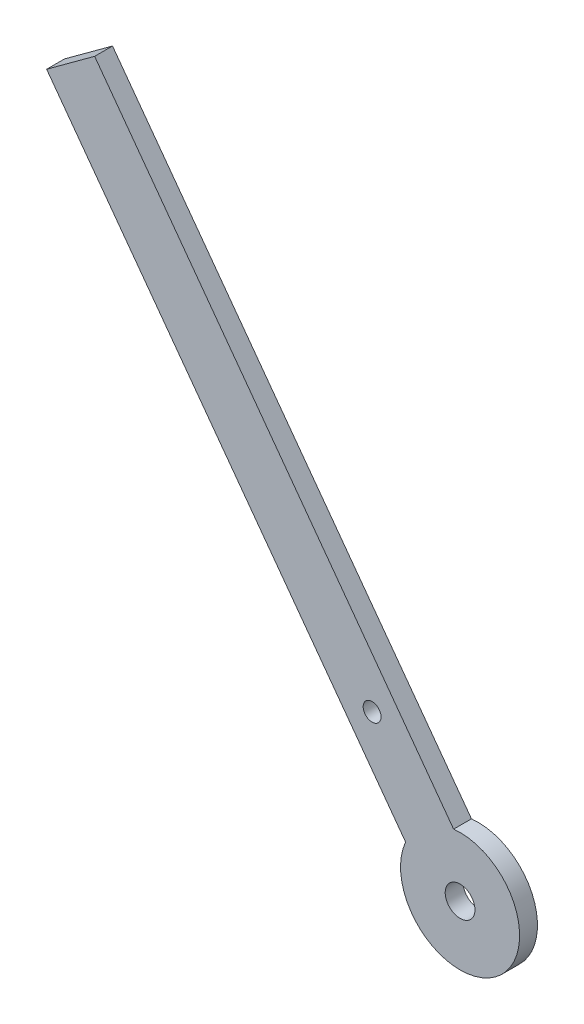
ISO-10303-21;
HEADER;
FILE_DESCRIPTION(('STEP AP214'),'2;1');
FILE_NAME('part.step','',(''),(''),'','','');
FILE_SCHEMA(('AUTOMOTIVE_DESIGN { 1 0 10303 214 1 1 1 1 }'));
ENDSEC;
DATA;
#1=APPLICATION_CONTEXT('core data for automotive mechanical design processes');
#2=APPLICATION_PROTOCOL_DEFINITION('international standard','automotive_design',2000,#1);
#3=PRODUCT_CONTEXT('',#1,'mechanical');
#4=PRODUCT('Part','Part','',(#3));
#5=PRODUCT_RELATED_PRODUCT_CATEGORY('part','',(#4));
#6=PRODUCT_DEFINITION_FORMATION('','',#4);
#7=PRODUCT_DEFINITION_CONTEXT('part definition',#1,'design');
#8=PRODUCT_DEFINITION('design','',#6,#7);
#9=PRODUCT_DEFINITION_SHAPE('','',#8);
#10=(LENGTH_UNIT() NAMED_UNIT(*) SI_UNIT(.MILLI.,.METRE.));
#11=(NAMED_UNIT(*) PLANE_ANGLE_UNIT() SI_UNIT($,.RADIAN.));
#12=(NAMED_UNIT(*) SI_UNIT($,.STERADIAN.) SOLID_ANGLE_UNIT());
#13=UNCERTAINTY_MEASURE_WITH_UNIT(LENGTH_MEASURE(1.E-05),#10,'distance_accuracy_value','');
#14=(GEOMETRIC_REPRESENTATION_CONTEXT(3) GLOBAL_UNCERTAINTY_ASSIGNED_CONTEXT((#13)) GLOBAL_UNIT_ASSIGNED_CONTEXT((#10,
#11,#12)) REPRESENTATION_CONTEXT('',''));
#15=CARTESIAN_POINT('',(0.,0.,0.));
#16=DIRECTION('',(0.,0.,1.));
#17=DIRECTION('',(1.,0.,0.));
#18=AXIS2_PLACEMENT_3D('',#15,#16,#17);
#19=CARTESIAN_POINT('',(0.,0.,3.));
#20=DIRECTION('',(0.,0.,1.));
#21=DIRECTION('',(1.,0.,0.));
#22=AXIS2_PLACEMENT_3D('',#19,#20,#21);
#23=PLANE('',#22);
#24=CARTESIAN_POINT('',(0.,0.,3.));
#25=DIRECTION('',(0.,0.,1.));
#26=DIRECTION('',(1.,0.,0.));
#27=AXIS2_PLACEMENT_3D('',#24,#25,#26);
#28=CIRCLE('',#27,2.49999999988457);
#29=CARTESIAN_POINT('',(2.49999999988457,0.,3.));
#30=VERTEX_POINT('',#29);
#31=EDGE_CURVE('E99',#30,#30,#28,.T.);
#32=ORIENTED_EDGE('',*,*,#31,.F.);
#33=EDGE_LOOP('',(#32));
#34=FACE_BOUND('',#33,.T.);
#35=DIRECTION('',(-0.806588676447801,-0.591113108487863,0.));
#36=VECTOR('',#35,1.);
#37=CARTESIAN_POINT('',(-65.4127267503671,89.2573078397623,3.));
#38=LINE('',#37,#36);
#39=CARTESIAN_POINT('',(-61.3797833681282,92.2128733822015,3.));
#40=VERTEX_POINT('',#39);
#41=CARTESIAN_POINT('',(-69.4456701326071,86.3017422973222,3.));
#42=VERTEX_POINT('',#41);
#43=EDGE_CURVE('E79',#40,#42,#38,.T.);
#44=ORIENTED_EDGE('',*,*,#43,.T.);
#45=DIRECTION('',(0.591113108487865,-0.8065886764478,0.));
#46=VECTOR('',#45,1.);
#47=CARTESIAN_POINT('',(-69.4456701326071,86.3017422973222,3.));
#48=LINE('',#47,#46);
#49=CARTESIAN_POINT('',(-9.15213306684436,4.029697299646,3.));
#50=VERTEX_POINT('',#49);
#51=EDGE_CURVE('E82',#42,#50,#48,.T.);
#52=ORIENTED_EDGE('',*,*,#51,.T.);
#53=CARTESIAN_POINT('',(0.,0.,3.));
#54=DIRECTION('',(0.,0.,1.));
#55=DIRECTION('',(1.,0.,0.));
#56=AXIS2_PLACEMENT_3D('',#53,#54,#55);
#57=CIRCLE('',#56,10.);
#58=CARTESIAN_POINT('',(-1.08624630236598,9.94082838452594,3.));
#59=VERTEX_POINT('',#58);
#60=EDGE_CURVE('E86',#50,#59,#57,.T.);
#61=ORIENTED_EDGE('',*,*,#60,.T.);
#62=DIRECTION('',(-0.591113108487865,0.8065886764478,0.));
#63=VECTOR('',#62,1.);
#64=CARTESIAN_POINT('',(-61.3797833681282,92.2128733822015,3.));
#65=LINE('',#64,#63);
#66=EDGE_CURVE('E50',#59,#40,#65,.T.);
#67=ORIENTED_EDGE('',*,*,#66,.T.);
#68=EDGE_LOOP('',(#44,#52,#61,#67));
#69=FACE_BOUND('',#68,.T.);
#70=CARTESIAN_POINT('',(-14.7778277121965,20.1647169111948,3.));
#71=DIRECTION('',(0.,0.,1.));
#72=DIRECTION('',(1.,0.,0.));
#73=AXIS2_PLACEMENT_3D('',#70,#71,#72);
#74=CIRCLE('',#73,1.50000000177059);
#75=CARTESIAN_POINT('',(-13.2778277104259,20.1647169111948,3.));
#76=VERTEX_POINT('',#75);
#77=EDGE_CURVE('E120',#76,#76,#74,.T.);
#78=ORIENTED_EDGE('',*,*,#77,.F.);
#79=EDGE_LOOP('',(#78));
#80=FACE_BOUND('',#79,.T.);
#81=ADVANCED_FACE('F33',(#34,#69,#80),#23,.T.);
#82=CARTESIAN_POINT('',(0.,0.,0.));
#83=DIRECTION('',(0.,0.,1.));
#84=DIRECTION('',(1.,0.,0.));
#85=AXIS2_PLACEMENT_3D('',#82,#83,#84);
#86=PLANE('',#85);
#87=DIRECTION('',(-0.806588676447799,-0.591113108487866,0.));
#88=VECTOR('',#87,1.);
#89=CARTESIAN_POINT('',(-65.4127267503671,89.2573078397623,0.));
#90=LINE('',#89,#88);
#91=CARTESIAN_POINT('',(-61.3797833681282,92.2128733822015,0.));
#92=VERTEX_POINT('',#91);
#93=CARTESIAN_POINT('',(-69.4456701326071,86.3017422973222,0.));
#94=VERTEX_POINT('',#93);
#95=EDGE_CURVE('E74',#92,#94,#90,.T.);
#96=ORIENTED_EDGE('',*,*,#95,.F.);
#97=DIRECTION('',(-0.591113108487865,0.8065886764478,0.));
#98=VECTOR('',#97,1.);
#99=CARTESIAN_POINT('',(-61.3797833681282,92.2128733822015,0.));
#100=LINE('',#99,#98);
#101=CARTESIAN_POINT('',(-1.08624630236598,9.94082838452594,0.));
#102=VERTEX_POINT('',#101);
#103=EDGE_CURVE('E102',#102,#92,#100,.T.);
#104=ORIENTED_EDGE('',*,*,#103,.F.);
#105=CARTESIAN_POINT('',(0.,0.,0.));
#106=DIRECTION('',(0.,0.,1.));
#107=DIRECTION('',(1.,0.,0.));
#108=AXIS2_PLACEMENT_3D('',#105,#106,#107);
#109=CIRCLE('',#108,10.);
#110=CARTESIAN_POINT('',(-9.15213306684436,4.029697299646,0.));
#111=VERTEX_POINT('',#110);
#112=EDGE_CURVE('E67',#111,#102,#109,.T.);
#113=ORIENTED_EDGE('',*,*,#112,.F.);
#114=DIRECTION('',(0.591113108487865,-0.8065886764478,0.));
#115=VECTOR('',#114,1.);
#116=CARTESIAN_POINT('',(-69.4456701326071,86.3017422973222,0.));
#117=LINE('',#116,#115);
#118=EDGE_CURVE('E90',#94,#111,#117,.T.);
#119=ORIENTED_EDGE('',*,*,#118,.F.);
#120=EDGE_LOOP('',(#96,#104,#113,#119));
#121=FACE_BOUND('',#120,.T.);
#122=CARTESIAN_POINT('',(0.,0.,0.));
#123=DIRECTION('',(0.,0.,1.));
#124=DIRECTION('',(1.,0.,0.));
#125=AXIS2_PLACEMENT_3D('',#122,#123,#124);
#126=CIRCLE('',#125,2.49999999988457);
#127=CARTESIAN_POINT('',(2.49999999988457,0.,0.));
#128=VERTEX_POINT('',#127);
#129=EDGE_CURVE('E115',#128,#128,#126,.T.);
#130=ORIENTED_EDGE('',*,*,#129,.T.);
#131=EDGE_LOOP('',(#130));
#132=FACE_BOUND('',#131,.T.);
#133=CARTESIAN_POINT('',(-14.7778277121965,20.1647169111948,0.));
#134=DIRECTION('',(0.,0.,1.));
#135=DIRECTION('',(1.,0.,0.));
#136=AXIS2_PLACEMENT_3D('',#133,#134,#135);
#137=CIRCLE('',#136,1.50000000177059);
#138=CARTESIAN_POINT('',(-13.2778277104259,20.1647169111948,0.));
#139=VERTEX_POINT('',#138);
#140=EDGE_CURVE('E118',#139,#139,#137,.T.);
#141=ORIENTED_EDGE('',*,*,#140,.T.);
#142=EDGE_LOOP('',(#141));
#143=FACE_BOUND('',#142,.T.);
#144=ADVANCED_FACE('F108',(#121,#132,#143),#86,.F.);
#145=CARTESIAN_POINT('',(-65.4127267503671,89.2573078397623,3.));
#146=DIRECTION('',(0.591113108487866,-0.806588676447799,0.));
#147=DIRECTION('',(0.806588676447799,0.591113108487866,0.));
#148=AXIS2_PLACEMENT_3D('',#145,#146,#147);
#149=PLANE('',#148);
#150=ORIENTED_EDGE('',*,*,#95,.T.);
#151=DIRECTION('',(0.,0.,-1.));
#152=VECTOR('',#151,1.);
#153=CARTESIAN_POINT('',(-69.4456701326071,86.3017422973222,3.));
#154=LINE('',#153,#152);
#155=EDGE_CURVE('E11',#42,#94,#154,.T.);
#156=ORIENTED_EDGE('',*,*,#155,.F.);
#157=ORIENTED_EDGE('',*,*,#43,.F.);
#158=DIRECTION('',(0.,0.,-1.));
#159=VECTOR('',#158,1.);
#160=CARTESIAN_POINT('',(-61.3797833681282,92.2128733822015,3.));
#161=LINE('',#160,#159);
#162=EDGE_CURVE('E94',#40,#92,#161,.T.);
#163=ORIENTED_EDGE('',*,*,#162,.T.);
#164=EDGE_LOOP('',(#150,#156,#157,#163));
#165=FACE_BOUND('',#164,.T.);
#166=ADVANCED_FACE('F35',(#165),#149,.F.);
#167=CARTESIAN_POINT('',(-69.4456701326071,86.3017422973222,3.));
#168=DIRECTION('',(0.8065886764478,0.591113108487865,0.));
#169=DIRECTION('',(-0.591113108487865,0.8065886764478,0.));
#170=AXIS2_PLACEMENT_3D('',#167,#168,#169);
#171=PLANE('',#170);
#172=ORIENTED_EDGE('',*,*,#118,.T.);
#173=DIRECTION('',(0.,0.,-1.));
#174=VECTOR('',#173,1.);
#175=CARTESIAN_POINT('',(-9.15213306684436,4.029697299646,3.));
#176=LINE('',#175,#174);
#177=EDGE_CURVE('E42',#50,#111,#176,.T.);
#178=ORIENTED_EDGE('',*,*,#177,.F.);
#179=ORIENTED_EDGE('',*,*,#51,.F.);
#180=ORIENTED_EDGE('',*,*,#155,.T.);
#181=EDGE_LOOP('',(#172,#178,#179,#180));
#182=FACE_BOUND('',#181,.T.);
#183=ADVANCED_FACE('F89',(#182),#171,.F.);
#184=CARTESIAN_POINT('',(0.,0.,3.));
#185=DIRECTION('',(0.,0.,-1.));
#186=DIRECTION('',(-1.,0.,0.));
#187=AXIS2_PLACEMENT_3D('',#184,#185,#186);
#188=CYLINDRICAL_SURFACE('',#187,10.);
#189=ORIENTED_EDGE('',*,*,#112,.T.);
#190=DIRECTION('',(0.,0.,-1.));
#191=VECTOR('',#190,1.);
#192=CARTESIAN_POINT('',(-1.08624630236598,9.94082838452594,3.));
#193=LINE('',#192,#191);
#194=EDGE_CURVE('E91',#59,#102,#193,.T.);
#195=ORIENTED_EDGE('',*,*,#194,.F.);
#196=ORIENTED_EDGE('',*,*,#60,.F.);
#197=ORIENTED_EDGE('',*,*,#177,.T.);
#198=EDGE_LOOP('',(#189,#195,#196,#197));
#199=FACE_BOUND('',#198,.T.);
#200=ADVANCED_FACE('F92',(#199),#188,.T.);
#201=CARTESIAN_POINT('',(-61.3797833681282,92.2128733822015,3.));
#202=DIRECTION('',(-0.8065886764478,-0.591113108487865,0.));
#203=DIRECTION('',(0.591113108487865,-0.8065886764478,0.));
#204=AXIS2_PLACEMENT_3D('',#201,#202,#203);
#205=PLANE('',#204);
#206=ORIENTED_EDGE('',*,*,#103,.T.);
#207=ORIENTED_EDGE('',*,*,#162,.F.);
#208=ORIENTED_EDGE('',*,*,#66,.F.);
#209=ORIENTED_EDGE('',*,*,#194,.T.);
#210=EDGE_LOOP('',(#206,#207,#208,#209));
#211=FACE_BOUND('',#210,.T.);
#212=ADVANCED_FACE('F107',(#211),#205,.F.);
#213=CARTESIAN_POINT('',(0.,0.,3.));
#214=DIRECTION('',(0.,0.,-1.));
#215=DIRECTION('',(-1.,0.,0.));
#216=AXIS2_PLACEMENT_3D('',#213,#214,#215);
#217=CYLINDRICAL_SURFACE('',#216,2.49999999988457);
#218=ORIENTED_EDGE('',*,*,#31,.T.);
#219=EDGE_LOOP('',(#218));
#220=FACE_BOUND('',#219,.T.);
#221=ORIENTED_EDGE('',*,*,#129,.F.);
#222=EDGE_LOOP('',(#221));
#223=FACE_BOUND('',#222,.T.);
#224=ADVANCED_FACE('F129',(#220,#223),#217,.F.);
#225=CARTESIAN_POINT('',(-14.7778277121965,20.1647169111948,3.));
#226=DIRECTION('',(0.,0.,-1.));
#227=DIRECTION('',(-1.,0.,0.));
#228=AXIS2_PLACEMENT_3D('',#225,#226,#227);
#229=CYLINDRICAL_SURFACE('',#228,1.50000000177059);
#230=ORIENTED_EDGE('',*,*,#77,.T.);
#231=EDGE_LOOP('',(#230));
#232=FACE_BOUND('',#231,.T.);
#233=ORIENTED_EDGE('',*,*,#140,.F.);
#234=EDGE_LOOP('',(#233));
#235=FACE_BOUND('',#234,.T.);
#236=ADVANCED_FACE('F186',(#232,#235),#229,.F.);
#237=CLOSED_SHELL('',(#81,#144,#166,#183,#200,#212,#224,#236));
#238=MANIFOLD_SOLID_BREP('B2',#237);
#239=ADVANCED_BREP_SHAPE_REPRESENTATION('',(#18,#238),#14);
#240=SHAPE_DEFINITION_REPRESENTATION(#9,#239);
ENDSEC;
END-ISO-10303-21;
